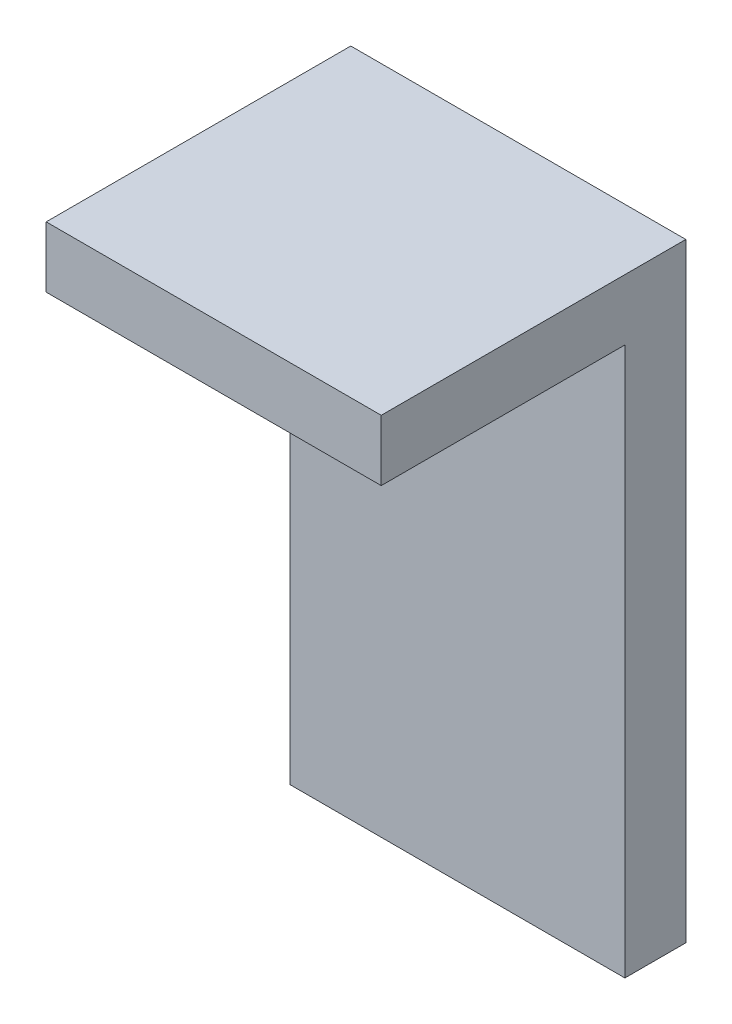
ISO-10303-21;
HEADER;
FILE_DESCRIPTION(('STEP AP214'),'2;1');
FILE_NAME('part.step','',(''),(''),'','','');
FILE_SCHEMA(('AUTOMOTIVE_DESIGN { 1 0 10303 214 1 1 1 1 }'));
ENDSEC;
DATA;
#1=APPLICATION_CONTEXT('core data for automotive mechanical design processes');
#2=APPLICATION_PROTOCOL_DEFINITION('international standard','automotive_design',2000,#1);
#3=PRODUCT_CONTEXT('',#1,'mechanical');
#4=PRODUCT('Part','Part','',(#3));
#5=PRODUCT_RELATED_PRODUCT_CATEGORY('part','',(#4));
#6=PRODUCT_DEFINITION_FORMATION('','',#4);
#7=PRODUCT_DEFINITION_CONTEXT('part definition',#1,'design');
#8=PRODUCT_DEFINITION('design','',#6,#7);
#9=PRODUCT_DEFINITION_SHAPE('','',#8);
#10=(LENGTH_UNIT() NAMED_UNIT(*) SI_UNIT(.MILLI.,.METRE.));
#11=(NAMED_UNIT(*) PLANE_ANGLE_UNIT() SI_UNIT($,.RADIAN.));
#12=(NAMED_UNIT(*) SI_UNIT($,.STERADIAN.) SOLID_ANGLE_UNIT());
#13=UNCERTAINTY_MEASURE_WITH_UNIT(LENGTH_MEASURE(1.E-05),#10,'distance_accuracy_value','');
#14=(GEOMETRIC_REPRESENTATION_CONTEXT(3) GLOBAL_UNCERTAINTY_ASSIGNED_CONTEXT((#13)) GLOBAL_UNIT_ASSIGNED_CONTEXT((#10,
#11,#12)) REPRESENTATION_CONTEXT('',''));
#15=CARTESIAN_POINT('',(0.,0.,0.));
#16=DIRECTION('',(0.,0.,1.));
#17=DIRECTION('',(1.,0.,0.));
#18=AXIS2_PLACEMENT_3D('',#15,#16,#17);
#19=CARTESIAN_POINT('',(0.,0.,10.));
#20=DIRECTION('',(0.,0.,-1.));
#21=DIRECTION('',(-1.,0.,0.));
#22=AXIS2_PLACEMENT_3D('',#19,#20,#21);
#23=PLANE('',#22);
#24=DIRECTION('',(1.,0.,0.));
#25=VECTOR('',#24,1.);
#26=CARTESIAN_POINT('',(0.,90.,10.));
#27=LINE('',#26,#25);
#28=CARTESIAN_POINT('',(0.,90.,10.));
#29=VERTEX_POINT('',#28);
#30=CARTESIAN_POINT('',(55.,90.,10.));
#31=VERTEX_POINT('',#30);
#32=EDGE_CURVE('E48',#29,#31,#27,.T.);
#33=ORIENTED_EDGE('',*,*,#32,.F.);
#34=DIRECTION('',(0.,-1.,0.));
#35=VECTOR('',#34,1.);
#36=CARTESIAN_POINT('',(0.,0.,10.));
#37=LINE('',#36,#35);
#38=CARTESIAN_POINT('',(0.,0.,10.));
#39=VERTEX_POINT('',#38);
#40=EDGE_CURVE('E85',#29,#39,#37,.T.);
#41=ORIENTED_EDGE('',*,*,#40,.T.);
#42=DIRECTION('',(1.,0.,0.));
#43=VECTOR('',#42,1.);
#44=CARTESIAN_POINT('',(0.,0.,10.));
#45=LINE('',#44,#43);
#46=CARTESIAN_POINT('',(55.,0.,10.));
#47=VERTEX_POINT('',#46);
#48=EDGE_CURVE('E54',#39,#47,#45,.T.);
#49=ORIENTED_EDGE('',*,*,#48,.T.);
#50=DIRECTION('',(0.,1.,0.));
#51=VECTOR('',#50,1.);
#52=CARTESIAN_POINT('',(55.,0.,10.));
#53=LINE('',#52,#51);
#54=EDGE_CURVE('E96',#47,#31,#53,.T.);
#55=ORIENTED_EDGE('',*,*,#54,.T.);
#56=EDGE_LOOP('',(#33,#41,#49,#55));
#57=FACE_BOUND('',#56,.T.);
#58=ADVANCED_FACE('F33',(#57),#23,.F.);
#59=CARTESIAN_POINT('',(0.,0.,10.));
#60=DIRECTION('',(1.,0.,0.));
#61=DIRECTION('',(0.,1.,0.));
#62=AXIS2_PLACEMENT_3D('',#59,#60,#61);
#63=PLANE('',#62);
#64=DIRECTION('',(0.,-1.,0.));
#65=VECTOR('',#64,1.);
#66=CARTESIAN_POINT('',(0.,0.,0.));
#67=LINE('',#66,#65);
#68=CARTESIAN_POINT('',(0.,100.,0.));
#69=VERTEX_POINT('',#68);
#70=CARTESIAN_POINT('',(0.,0.,0.));
#71=VERTEX_POINT('',#70);
#72=EDGE_CURVE('E92',#69,#71,#67,.T.);
#73=ORIENTED_EDGE('',*,*,#72,.T.);
#74=DIRECTION('',(0.,0.,-1.));
#75=VECTOR('',#74,1.);
#76=CARTESIAN_POINT('',(0.,0.,10.));
#77=LINE('',#76,#75);
#78=EDGE_CURVE('E11',#39,#71,#77,.T.);
#79=ORIENTED_EDGE('',*,*,#78,.F.);
#80=ORIENTED_EDGE('',*,*,#40,.F.);
#81=DIRECTION('',(0.,0.,-1.));
#82=VECTOR('',#81,1.);
#83=CARTESIAN_POINT('',(0.,90.,50.));
#84=LINE('',#83,#82);
#85=CARTESIAN_POINT('',(0.,90.,50.));
#86=VERTEX_POINT('',#85);
#87=EDGE_CURVE('E100',#86,#29,#84,.T.);
#88=ORIENTED_EDGE('',*,*,#87,.F.);
#89=DIRECTION('',(0.,-1.,0.));
#90=VECTOR('',#89,1.);
#91=CARTESIAN_POINT('',(0.,100.,50.));
#92=LINE('',#91,#90);
#93=CARTESIAN_POINT('',(0.,100.,50.));
#94=VERTEX_POINT('',#93);
#95=EDGE_CURVE('E95',#94,#86,#92,.T.);
#96=ORIENTED_EDGE('',*,*,#95,.F.);
#97=DIRECTION('',(0.,0.,-1.));
#98=VECTOR('',#97,1.);
#99=CARTESIAN_POINT('',(0.,100.,10.));
#100=LINE('',#99,#98);
#101=EDGE_CURVE('E78',#94,#69,#100,.T.);
#102=ORIENTED_EDGE('',*,*,#101,.T.);
#103=EDGE_LOOP('',(#73,#79,#80,#88,#96,#102));
#104=FACE_BOUND('',#103,.T.);
#105=ADVANCED_FACE('F35',(#104),#63,.F.);
#106=CARTESIAN_POINT('',(0.,0.,10.));
#107=DIRECTION('',(0.,1.,0.));
#108=DIRECTION('',(0.,0.,1.));
#109=AXIS2_PLACEMENT_3D('',#106,#107,#108);
#110=PLANE('',#109);
#111=DIRECTION('',(1.,0.,0.));
#112=VECTOR('',#111,1.);
#113=CARTESIAN_POINT('',(0.,0.,0.));
#114=LINE('',#113,#112);
#115=CARTESIAN_POINT('',(55.,0.,0.));
#116=VERTEX_POINT('',#115);
#117=EDGE_CURVE('E99',#71,#116,#114,.T.);
#118=ORIENTED_EDGE('',*,*,#117,.T.);
#119=DIRECTION('',(0.,0.,-1.));
#120=VECTOR('',#119,1.);
#121=CARTESIAN_POINT('',(55.,0.,10.));
#122=LINE('',#121,#120);
#123=EDGE_CURVE('E41',#47,#116,#122,.T.);
#124=ORIENTED_EDGE('',*,*,#123,.F.);
#125=ORIENTED_EDGE('',*,*,#48,.F.);
#126=ORIENTED_EDGE('',*,*,#78,.T.);
#127=EDGE_LOOP('',(#118,#124,#125,#126));
#128=FACE_BOUND('',#127,.T.);
#129=ADVANCED_FACE('F116',(#128),#110,.F.);
#130=CARTESIAN_POINT('',(55.,0.,10.));
#131=DIRECTION('',(-1.,0.,0.));
#132=DIRECTION('',(0.,-1.,0.));
#133=AXIS2_PLACEMENT_3D('',#130,#131,#132);
#134=PLANE('',#133);
#135=DIRECTION('',(0.,1.,0.));
#136=VECTOR('',#135,1.);
#137=CARTESIAN_POINT('',(55.,0.,0.));
#138=LINE('',#137,#136);
#139=CARTESIAN_POINT('',(55.,100.,0.));
#140=VERTEX_POINT('',#139);
#141=EDGE_CURVE('E86',#116,#140,#138,.T.);
#142=ORIENTED_EDGE('',*,*,#141,.T.);
#143=DIRECTION('',(0.,0.,-1.));
#144=VECTOR('',#143,1.);
#145=CARTESIAN_POINT('',(55.,100.,10.));
#146=LINE('',#145,#144);
#147=CARTESIAN_POINT('',(55.,100.,50.));
#148=VERTEX_POINT('',#147);
#149=EDGE_CURVE('E81',#148,#140,#146,.T.);
#150=ORIENTED_EDGE('',*,*,#149,.F.);
#151=DIRECTION('',(0.,1.,0.));
#152=VECTOR('',#151,1.);
#153=CARTESIAN_POINT('',(55.,100.,50.));
#154=LINE('',#153,#152);
#155=CARTESIAN_POINT('',(55.,90.,50.));
#156=VERTEX_POINT('',#155);
#157=EDGE_CURVE('E131',#156,#148,#154,.T.);
#158=ORIENTED_EDGE('',*,*,#157,.F.);
#159=DIRECTION('',(0.,0.,-1.));
#160=VECTOR('',#159,1.);
#161=CARTESIAN_POINT('',(55.,90.,50.));
#162=LINE('',#161,#160);
#163=EDGE_CURVE('E104',#156,#31,#162,.T.);
#164=ORIENTED_EDGE('',*,*,#163,.T.);
#165=ORIENTED_EDGE('',*,*,#54,.F.);
#166=ORIENTED_EDGE('',*,*,#123,.T.);
#167=EDGE_LOOP('',(#142,#150,#158,#164,#165,#166));
#168=FACE_BOUND('',#167,.T.);
#169=ADVANCED_FACE('F113',(#168),#134,.F.);
#170=CARTESIAN_POINT('',(0.,100.,10.));
#171=DIRECTION('',(0.,-1.,0.));
#172=DIRECTION('',(0.,0.,-1.));
#173=AXIS2_PLACEMENT_3D('',#170,#171,#172);
#174=PLANE('',#173);
#175=DIRECTION('',(-1.,0.,0.));
#176=VECTOR('',#175,1.);
#177=CARTESIAN_POINT('',(0.,100.,0.));
#178=LINE('',#177,#176);
#179=EDGE_CURVE('E74',#140,#69,#178,.T.);
#180=ORIENTED_EDGE('',*,*,#179,.T.);
#181=ORIENTED_EDGE('',*,*,#101,.F.);
#182=DIRECTION('',(-1.,0.,0.));
#183=VECTOR('',#182,1.);
#184=CARTESIAN_POINT('',(0.,100.,50.));
#185=LINE('',#184,#183);
#186=EDGE_CURVE('E134',#148,#94,#185,.T.);
#187=ORIENTED_EDGE('',*,*,#186,.F.);
#188=ORIENTED_EDGE('',*,*,#149,.T.);
#189=EDGE_LOOP('',(#180,#181,#187,#188));
#190=FACE_BOUND('',#189,.T.);
#191=ADVANCED_FACE('F76',(#190),#174,.F.);
#192=CARTESIAN_POINT('',(0.,0.,0.));
#193=DIRECTION('',(0.,0.,-1.));
#194=DIRECTION('',(-1.,0.,0.));
#195=AXIS2_PLACEMENT_3D('',#192,#193,#194);
#196=PLANE('',#195);
#197=ORIENTED_EDGE('',*,*,#72,.F.);
#198=ORIENTED_EDGE('',*,*,#179,.F.);
#199=ORIENTED_EDGE('',*,*,#141,.F.);
#200=ORIENTED_EDGE('',*,*,#117,.F.);
#201=EDGE_LOOP('',(#197,#198,#199,#200));
#202=FACE_BOUND('',#201,.T.);
#203=ADVANCED_FACE('F98',(#202),#196,.T.);
#204=CARTESIAN_POINT('',(0.,90.,50.));
#205=DIRECTION('',(0.,1.,0.));
#206=DIRECTION('',(0.,0.,1.));
#207=AXIS2_PLACEMENT_3D('',#204,#205,#206);
#208=PLANE('',#207);
#209=ORIENTED_EDGE('',*,*,#32,.T.);
#210=ORIENTED_EDGE('',*,*,#163,.F.);
#211=DIRECTION('',(1.,0.,0.));
#212=VECTOR('',#211,1.);
#213=CARTESIAN_POINT('',(0.,90.,50.));
#214=LINE('',#213,#212);
#215=EDGE_CURVE('E125',#86,#156,#214,.T.);
#216=ORIENTED_EDGE('',*,*,#215,.F.);
#217=ORIENTED_EDGE('',*,*,#87,.T.);
#218=EDGE_LOOP('',(#209,#210,#216,#217));
#219=FACE_BOUND('',#218,.T.);
#220=ADVANCED_FACE('F121',(#219),#208,.F.);
#221=CARTESIAN_POINT('',(0.,0.,50.));
#222=DIRECTION('',(0.,0.,1.));
#223=DIRECTION('',(1.,0.,0.));
#224=AXIS2_PLACEMENT_3D('',#221,#222,#223);
#225=PLANE('',#224);
#226=ORIENTED_EDGE('',*,*,#95,.T.);
#227=ORIENTED_EDGE('',*,*,#215,.T.);
#228=ORIENTED_EDGE('',*,*,#157,.T.);
#229=ORIENTED_EDGE('',*,*,#186,.T.);
#230=EDGE_LOOP('',(#226,#227,#228,#229));
#231=FACE_BOUND('',#230,.T.);
#232=ADVANCED_FACE('F133',(#231),#225,.T.);
#233=CLOSED_SHELL('',(#58,#105,#129,#169,#191,#203,#220,#232));
#234=MANIFOLD_SOLID_BREP('B2',#233);
#235=ADVANCED_BREP_SHAPE_REPRESENTATION('',(#18,#234),#14);
#236=SHAPE_DEFINITION_REPRESENTATION(#9,#235);
ENDSEC;
END-ISO-10303-21;
